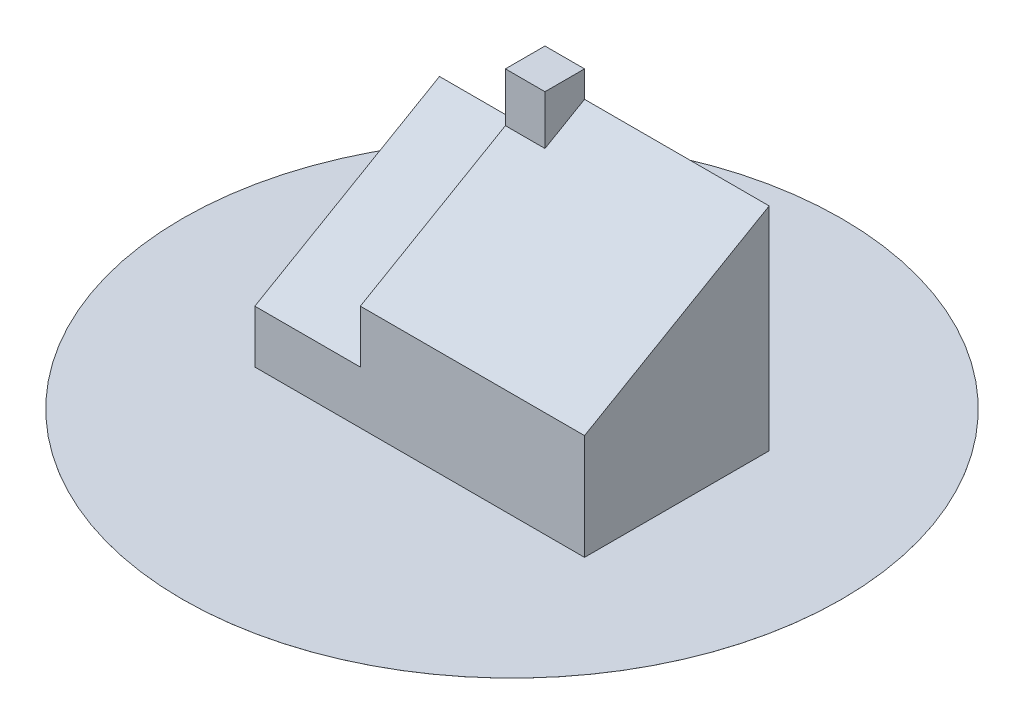
ISO-10303-21;
HEADER;
FILE_DESCRIPTION(('STEP AP214'),'2;1');
FILE_NAME('part.step','',(''),(''),'','','');
FILE_SCHEMA(('AUTOMOTIVE_DESIGN { 1 0 10303 214 1 1 1 1 }'));
ENDSEC;
DATA;
#1=APPLICATION_CONTEXT('core data for automotive mechanical design processes');
#2=APPLICATION_PROTOCOL_DEFINITION('international standard','automotive_design',2000,#1);
#3=PRODUCT_CONTEXT('',#1,'mechanical');
#4=PRODUCT('Part','Part','',(#3));
#5=PRODUCT_RELATED_PRODUCT_CATEGORY('part','',(#4));
#6=PRODUCT_DEFINITION_FORMATION('','',#4);
#7=PRODUCT_DEFINITION_CONTEXT('part definition',#1,'design');
#8=PRODUCT_DEFINITION('design','',#6,#7);
#9=PRODUCT_DEFINITION_SHAPE('','',#8);
#10=(LENGTH_UNIT() NAMED_UNIT(*) SI_UNIT(.MILLI.,.METRE.));
#11=(NAMED_UNIT(*) PLANE_ANGLE_UNIT() SI_UNIT($,.RADIAN.));
#12=(NAMED_UNIT(*) SI_UNIT($,.STERADIAN.) SOLID_ANGLE_UNIT());
#13=UNCERTAINTY_MEASURE_WITH_UNIT(LENGTH_MEASURE(1.E-05),#10,'distance_accuracy_value','');
#14=(GEOMETRIC_REPRESENTATION_CONTEXT(3) GLOBAL_UNCERTAINTY_ASSIGNED_CONTEXT((#13)) GLOBAL_UNIT_ASSIGNED_CONTEXT((#10,
#11,#12)) REPRESENTATION_CONTEXT('',''));
#15=CARTESIAN_POINT('',(0.,0.,0.));
#16=DIRECTION('',(0.,0.,1.));
#17=DIRECTION('',(1.,0.,0.));
#18=AXIS2_PLACEMENT_3D('',#15,#16,#17);
#19=CARTESIAN_POINT('',(40.,40.,70.));
#20=DIRECTION('',(0.,0.866025403784438,0.500000000000001));
#21=DIRECTION('',(0.,-0.500000000000001,0.866025403784438));
#22=AXIS2_PLACEMENT_3D('',#19,#20,#21);
#23=PLANE('',#22);
#24=DIRECTION('',(0.,-0.500000000000001,0.866025403784438));
#25=VECTOR('',#24,1.);
#26=CARTESIAN_POINT('',(55.,40.,70.));
#27=LINE('',#26,#25);
#28=CARTESIAN_POINT('',(55.,80.414518843274,0.));
#29=VERTEX_POINT('',#28);
#30=CARTESIAN_POINT('',(55.,71.7542648054296,15.));
#31=VERTEX_POINT('',#30);
#32=EDGE_CURVE('E38',#29,#31,#27,.T.);
#33=ORIENTED_EDGE('',*,*,#32,.T.);
#34=DIRECTION('',(-1.,0.,0.));
#35=VECTOR('',#34,1.);
#36=CARTESIAN_POINT('',(40.,71.7542648054295,15.));
#37=LINE('',#36,#35);
#38=CARTESIAN_POINT('',(40.,71.7542648054295,15.));
#39=VERTEX_POINT('',#38);
#40=EDGE_CURVE('E151',#31,#39,#37,.T.);
#41=ORIENTED_EDGE('',*,*,#40,.T.);
#42=DIRECTION('',(0.,-0.500000000000001,0.866025403784438));
#43=VECTOR('',#42,1.);
#44=CARTESIAN_POINT('',(40.,40.,70.));
#45=LINE('',#44,#43);
#46=CARTESIAN_POINT('',(40.,40.,70.));
#47=VERTEX_POINT('',#46);
#48=EDGE_CURVE('E145',#39,#47,#45,.T.);
#49=ORIENTED_EDGE('',*,*,#48,.T.);
#50=DIRECTION('',(1.,0.,0.));
#51=VECTOR('',#50,1.);
#52=CARTESIAN_POINT('',(40.,40.,70.));
#53=LINE('',#52,#51);
#54=CARTESIAN_POINT('',(125.,40.,70.));
#55=VERTEX_POINT('',#54);
#56=EDGE_CURVE('E140',#47,#55,#53,.T.);
#57=ORIENTED_EDGE('',*,*,#56,.T.);
#58=DIRECTION('',(0.,-0.500000000000001,0.866025403784438));
#59=VECTOR('',#58,1.);
#60=CARTESIAN_POINT('',(125.,40.,70.));
#61=LINE('',#60,#59);
#62=CARTESIAN_POINT('',(125.,80.414518843274,0.));
#63=VERTEX_POINT('',#62);
#64=EDGE_CURVE('E149',#63,#55,#61,.T.);
#65=ORIENTED_EDGE('',*,*,#64,.F.);
#66=DIRECTION('',(1.,0.,0.));
#67=VECTOR('',#66,1.);
#68=CARTESIAN_POINT('',(40.,80.414518843274,0.));
#69=LINE('',#68,#67);
#70=EDGE_CURVE('E117',#29,#63,#69,.T.);
#71=ORIENTED_EDGE('',*,*,#70,.F.);
#72=EDGE_LOOP('',(#33,#41,#49,#57,#65,#71));
#73=FACE_BOUND('',#72,.T.);
#74=ADVANCED_FACE('F30',(#73),#23,.T.);
#75=CARTESIAN_POINT('',(0.,20.,0.));
#76=DIRECTION('',(1.,0.,0.));
#77=DIRECTION('',(0.,0.,-1.));
#78=AXIS2_PLACEMENT_3D('',#75,#76,#77);
#79=PLANE('',#78);
#80=DIRECTION('',(0.,-1.,0.));
#81=VECTOR('',#80,1.);
#82=CARTESIAN_POINT('',(0.,20.,0.));
#83=LINE('',#82,#81);
#84=CARTESIAN_POINT('',(0.,60.4145188432732,0.));
#85=VERTEX_POINT('',#84);
#86=CARTESIAN_POINT('',(0.,0.00999999999999959,0.));
#87=VERTEX_POINT('',#86);
#88=EDGE_CURVE('E118',#85,#87,#83,.T.);
#89=ORIENTED_EDGE('',*,*,#88,.T.);
#90=DIRECTION('',(0.,0.,1.));
#91=VECTOR('',#90,1.);
#92=CARTESIAN_POINT('',(0.,0.00999999999999959,0.));
#93=LINE('',#92,#91);
#94=CARTESIAN_POINT('',(0.,0.00999999999999959,70.));
#95=VERTEX_POINT('',#94);
#96=EDGE_CURVE('E45',#87,#95,#93,.T.);
#97=ORIENTED_EDGE('',*,*,#96,.T.);
#98=DIRECTION('',(0.,-1.,0.));
#99=VECTOR('',#98,1.);
#100=CARTESIAN_POINT('',(0.,20.,70.));
#101=LINE('',#100,#99);
#102=CARTESIAN_POINT('',(0.,20.,70.));
#103=VERTEX_POINT('',#102);
#104=EDGE_CURVE('E120',#103,#95,#101,.T.);
#105=ORIENTED_EDGE('',*,*,#104,.F.);
#106=DIRECTION('',(0.,0.499999999999995,-0.866025403784442));
#107=VECTOR('',#106,1.);
#108=CARTESIAN_POINT('',(0.,20.,70.));
#109=LINE('',#108,#107);
#110=EDGE_CURVE('E137',#103,#85,#109,.T.);
#111=ORIENTED_EDGE('',*,*,#110,.T.);
#112=EDGE_LOOP('',(#89,#97,#105,#111));
#113=FACE_BOUND('',#112,.T.);
#114=ADVANCED_FACE('F32',(#113),#79,.F.);
#115=CARTESIAN_POINT('',(0.,20.,70.));
#116=DIRECTION('',(0.,0.,-1.));
#117=DIRECTION('',(-1.,0.,0.));
#118=AXIS2_PLACEMENT_3D('',#115,#116,#117);
#119=PLANE('',#118);
#120=ORIENTED_EDGE('',*,*,#104,.T.);
#121=DIRECTION('',(1.,0.,0.));
#122=VECTOR('',#121,1.);
#123=CARTESIAN_POINT('',(0.,0.00999999999999959,70.));
#124=LINE('',#123,#122);
#125=CARTESIAN_POINT('',(125.,0.00999999999999959,70.));
#126=VERTEX_POINT('',#125);
#127=EDGE_CURVE('E112',#95,#126,#124,.T.);
#128=ORIENTED_EDGE('',*,*,#127,.T.);
#129=DIRECTION('',(0.,-1.,0.));
#130=VECTOR('',#129,1.);
#131=CARTESIAN_POINT('',(125.,20.,70.));
#132=LINE('',#131,#130);
#133=EDGE_CURVE('E111',#55,#126,#132,.T.);
#134=ORIENTED_EDGE('',*,*,#133,.F.);
#135=ORIENTED_EDGE('',*,*,#56,.F.);
#136=DIRECTION('',(0.,-1.,0.));
#137=VECTOR('',#136,1.);
#138=CARTESIAN_POINT('',(40.,20.,70.));
#139=LINE('',#138,#137);
#140=CARTESIAN_POINT('',(40.,20.,70.));
#141=VERTEX_POINT('',#140);
#142=EDGE_CURVE('E142',#47,#141,#139,.T.);
#143=ORIENTED_EDGE('',*,*,#142,.T.);
#144=DIRECTION('',(1.,0.,0.));
#145=VECTOR('',#144,1.);
#146=CARTESIAN_POINT('',(0.,20.,70.));
#147=LINE('',#146,#145);
#148=EDGE_CURVE('E122',#103,#141,#147,.T.);
#149=ORIENTED_EDGE('',*,*,#148,.F.);
#150=EDGE_LOOP('',(#120,#128,#134,#135,#143,#149));
#151=FACE_BOUND('',#150,.T.);
#152=ADVANCED_FACE('F198',(#151),#119,.F.);
#153=CARTESIAN_POINT('',(125.,20.,0.));
#154=DIRECTION('',(-1.,0.,0.));
#155=DIRECTION('',(0.,0.,1.));
#156=AXIS2_PLACEMENT_3D('',#153,#154,#155);
#157=PLANE('',#156);
#158=ORIENTED_EDGE('',*,*,#133,.T.);
#159=DIRECTION('',(0.,0.,-1.));
#160=VECTOR('',#159,1.);
#161=CARTESIAN_POINT('',(125.,0.00999999999999959,0.));
#162=LINE('',#161,#160);
#163=CARTESIAN_POINT('',(125.,0.00999999999999959,0.));
#164=VERTEX_POINT('',#163);
#165=EDGE_CURVE('E100',#126,#164,#162,.T.);
#166=ORIENTED_EDGE('',*,*,#165,.T.);
#167=DIRECTION('',(0.,-1.,0.));
#168=VECTOR('',#167,1.);
#169=CARTESIAN_POINT('',(125.,20.,0.));
#170=LINE('',#169,#168);
#171=EDGE_CURVE('E109',#63,#164,#170,.T.);
#172=ORIENTED_EDGE('',*,*,#171,.F.);
#173=ORIENTED_EDGE('',*,*,#64,.T.);
#174=EDGE_LOOP('',(#158,#166,#172,#173));
#175=FACE_BOUND('',#174,.T.);
#176=ADVANCED_FACE('F107',(#175),#157,.F.);
#177=CARTESIAN_POINT('',(0.,20.,0.));
#178=DIRECTION('',(0.,0.,1.));
#179=DIRECTION('',(1.,0.,0.));
#180=AXIS2_PLACEMENT_3D('',#177,#178,#179);
#181=PLANE('',#180);
#182=ORIENTED_EDGE('',*,*,#171,.T.);
#183=DIRECTION('',(-1.,0.,0.));
#184=VECTOR('',#183,1.);
#185=CARTESIAN_POINT('',(0.,0.00999999999999959,0.));
#186=LINE('',#185,#184);
#187=EDGE_CURVE('E11',#164,#87,#186,.T.);
#188=ORIENTED_EDGE('',*,*,#187,.T.);
#189=ORIENTED_EDGE('',*,*,#88,.F.);
#190=DIRECTION('',(-1.,0.,0.));
#191=VECTOR('',#190,1.);
#192=CARTESIAN_POINT('',(40.,60.4145188432732,0.));
#193=LINE('',#192,#191);
#194=CARTESIAN_POINT('',(40.,60.4145188432732,0.));
#195=VERTEX_POINT('',#194);
#196=EDGE_CURVE('E130',#195,#85,#193,.T.);
#197=ORIENTED_EDGE('',*,*,#196,.F.);
#198=DIRECTION('',(0.,1.,0.));
#199=VECTOR('',#198,1.);
#200=CARTESIAN_POINT('',(40.,80.414518843274,0.));
#201=LINE('',#200,#199);
#202=CARTESIAN_POINT('',(40.,90.414518843274,0.));
#203=VERTEX_POINT('',#202);
#204=EDGE_CURVE('E147',#195,#203,#201,.T.);
#205=ORIENTED_EDGE('',*,*,#204,.T.);
#206=DIRECTION('',(-1.,0.,0.));
#207=VECTOR('',#206,1.);
#208=CARTESIAN_POINT('',(40.,90.414518843274,0.));
#209=LINE('',#208,#207);
#210=CARTESIAN_POINT('',(55.,90.414518843274,0.));
#211=VERTEX_POINT('',#210);
#212=EDGE_CURVE('E160',#211,#203,#209,.T.);
#213=ORIENTED_EDGE('',*,*,#212,.F.);
#214=DIRECTION('',(0.,-1.,0.));
#215=VECTOR('',#214,1.);
#216=CARTESIAN_POINT('',(55.,90.414518843274,0.));
#217=LINE('',#216,#215);
#218=EDGE_CURVE('E52',#211,#29,#217,.T.);
#219=ORIENTED_EDGE('',*,*,#218,.T.);
#220=ORIENTED_EDGE('',*,*,#70,.T.);
#221=EDGE_LOOP('',(#182,#188,#189,#197,#205,#213,#219,#220));
#222=FACE_BOUND('',#221,.T.);
#223=ADVANCED_FACE('F115',(#222),#181,.F.);
#224=CARTESIAN_POINT('',(40.,20.,70.));
#225=DIRECTION('',(0.,0.866025403784442,0.499999999999995));
#226=DIRECTION('',(0.,-0.499999999999995,0.866025403784442));
#227=AXIS2_PLACEMENT_3D('',#224,#225,#226);
#228=PLANE('',#227);
#229=ORIENTED_EDGE('',*,*,#110,.F.);
#230=ORIENTED_EDGE('',*,*,#148,.T.);
#231=DIRECTION('',(0.,0.499999999999995,-0.866025403784442));
#232=VECTOR('',#231,1.);
#233=CARTESIAN_POINT('',(40.,20.,70.));
#234=LINE('',#233,#232);
#235=EDGE_CURVE('E131',#141,#195,#234,.T.);
#236=ORIENTED_EDGE('',*,*,#235,.T.);
#237=ORIENTED_EDGE('',*,*,#196,.T.);
#238=EDGE_LOOP('',(#229,#230,#236,#237));
#239=FACE_BOUND('',#238,.T.);
#240=ADVANCED_FACE('F204',(#239),#228,.T.);
#241=CARTESIAN_POINT('',(40.,20.,70.));
#242=DIRECTION('',(-1.,0.,0.));
#243=DIRECTION('',(0.,0.,1.));
#244=AXIS2_PLACEMENT_3D('',#241,#242,#243);
#245=PLANE('',#244);
#246=ORIENTED_EDGE('',*,*,#48,.F.);
#247=DIRECTION('',(0.,-1.,0.));
#248=VECTOR('',#247,1.);
#249=CARTESIAN_POINT('',(40.,90.414518843274,15.));
#250=LINE('',#249,#248);
#251=CARTESIAN_POINT('',(40.,90.414518843274,15.));
#252=VERTEX_POINT('',#251);
#253=EDGE_CURVE('E154',#252,#39,#250,.T.);
#254=ORIENTED_EDGE('',*,*,#253,.F.);
#255=DIRECTION('',(0.,0.,1.));
#256=VECTOR('',#255,1.);
#257=CARTESIAN_POINT('',(40.,90.414518843274,0.));
#258=LINE('',#257,#256);
#259=EDGE_CURVE('E167',#203,#252,#258,.T.);
#260=ORIENTED_EDGE('',*,*,#259,.F.);
#261=ORIENTED_EDGE('',*,*,#204,.F.);
#262=ORIENTED_EDGE('',*,*,#235,.F.);
#263=ORIENTED_EDGE('',*,*,#142,.F.);
#264=EDGE_LOOP('',(#246,#254,#260,#261,#262,#263));
#265=FACE_BOUND('',#264,.T.);
#266=ADVANCED_FACE('F202',(#265),#245,.T.);
#267=CARTESIAN_POINT('',(40.,90.414518843274,15.));
#268=DIRECTION('',(0.,0.,-1.));
#269=DIRECTION('',(-1.,0.,0.));
#270=AXIS2_PLACEMENT_3D('',#267,#268,#269);
#271=PLANE('',#270);
#272=ORIENTED_EDGE('',*,*,#40,.F.);
#273=DIRECTION('',(0.,-1.,0.));
#274=VECTOR('',#273,1.);
#275=CARTESIAN_POINT('',(55.,90.414518843274,15.));
#276=LINE('',#275,#274);
#277=CARTESIAN_POINT('',(55.,90.414518843274,15.));
#278=VERTEX_POINT('',#277);
#279=EDGE_CURVE('E156',#278,#31,#276,.T.);
#280=ORIENTED_EDGE('',*,*,#279,.F.);
#281=DIRECTION('',(1.,0.,0.));
#282=VECTOR('',#281,1.);
#283=CARTESIAN_POINT('',(40.,90.414518843274,15.));
#284=LINE('',#283,#282);
#285=EDGE_CURVE('E165',#252,#278,#284,.T.);
#286=ORIENTED_EDGE('',*,*,#285,.F.);
#287=ORIENTED_EDGE('',*,*,#253,.T.);
#288=EDGE_LOOP('',(#272,#280,#286,#287));
#289=FACE_BOUND('',#288,.T.);
#290=ADVANCED_FACE('F211',(#289),#271,.F.);
#291=CARTESIAN_POINT('',(55.,90.414518843274,0.));
#292=DIRECTION('',(-1.,0.,0.));
#293=DIRECTION('',(0.,0.,1.));
#294=AXIS2_PLACEMENT_3D('',#291,#292,#293);
#295=PLANE('',#294);
#296=ORIENTED_EDGE('',*,*,#32,.F.);
#297=ORIENTED_EDGE('',*,*,#218,.F.);
#298=DIRECTION('',(0.,0.,-1.));
#299=VECTOR('',#298,1.);
#300=CARTESIAN_POINT('',(55.,90.414518843274,0.));
#301=LINE('',#300,#299);
#302=EDGE_CURVE('E163',#278,#211,#301,.T.);
#303=ORIENTED_EDGE('',*,*,#302,.F.);
#304=ORIENTED_EDGE('',*,*,#279,.T.);
#305=EDGE_LOOP('',(#296,#297,#303,#304));
#306=FACE_BOUND('',#305,.T.);
#307=ADVANCED_FACE('F229',(#306),#295,.F.);
#308=CARTESIAN_POINT('',(40.,90.414518843274,15.));
#309=DIRECTION('',(0.,1.,0.));
#310=DIRECTION('',(0.,0.,1.));
#311=AXIS2_PLACEMENT_3D('',#308,#309,#310);
#312=PLANE('',#311);
#313=ORIENTED_EDGE('',*,*,#259,.T.);
#314=ORIENTED_EDGE('',*,*,#285,.T.);
#315=ORIENTED_EDGE('',*,*,#302,.T.);
#316=ORIENTED_EDGE('',*,*,#212,.T.);
#317=EDGE_LOOP('',(#313,#314,#315,#316));
#318=FACE_BOUND('',#317,.T.);
#319=ADVANCED_FACE('F225',(#318),#312,.T.);
#320=CARTESIAN_POINT('',(62.5,0.01,35.));
#321=DIRECTION('',(0.,1.,0.));
#322=DIRECTION('',(0.,0.,1.));
#323=AXIS2_PLACEMENT_3D('',#320,#321,#322);
#324=PLANE('',#323);
#325=CARTESIAN_POINT('',(62.5,0.01,35.));
#326=DIRECTION('',(0.,1.,0.));
#327=DIRECTION('',(0.,0.,1.));
#328=AXIS2_PLACEMENT_3D('',#325,#326,#327);
#329=CIRCLE('',#328,125.);
#330=CARTESIAN_POINT('',(62.5,0.01,160.));
#331=VERTEX_POINT('',#330);
#332=EDGE_CURVE('E113',#331,#331,#329,.T.);
#333=ORIENTED_EDGE('',*,*,#332,.T.);
#334=EDGE_LOOP('',(#333));
#335=FACE_BOUND('',#334,.T.);
#336=ORIENTED_EDGE('',*,*,#96,.F.);
#337=ORIENTED_EDGE('',*,*,#187,.F.);
#338=ORIENTED_EDGE('',*,*,#165,.F.);
#339=ORIENTED_EDGE('',*,*,#127,.F.);
#340=EDGE_LOOP('',(#336,#337,#338,#339));
#341=FACE_BOUND('',#340,.T.);
#342=ADVANCED_FACE('F99',(#335,#341),#324,.T.);
#343=CARTESIAN_POINT('',(62.5,0.01,35.));
#344=DIRECTION('',(0.,-1.,0.));
#345=DIRECTION('',(0.,0.,-1.));
#346=AXIS2_PLACEMENT_3D('',#343,#344,#345);
#347=CYLINDRICAL_SURFACE('',#346,125.);
#348=ORIENTED_EDGE('',*,*,#332,.F.);
#349=EDGE_LOOP('',(#348));
#350=FACE_BOUND('',#349,.T.);
#351=CARTESIAN_POINT('',(62.5,0.,35.));
#352=DIRECTION('',(0.,1.,0.));
#353=DIRECTION('',(0.,0.,1.));
#354=AXIS2_PLACEMENT_3D('',#351,#352,#353);
#355=CIRCLE('',#354,125.);
#356=CARTESIAN_POINT('',(62.5,0.,160.));
#357=VERTEX_POINT('',#356);
#358=EDGE_CURVE('E172',#357,#357,#355,.T.);
#359=ORIENTED_EDGE('',*,*,#358,.T.);
#360=EDGE_LOOP('',(#359));
#361=FACE_BOUND('',#360,.T.);
#362=ADVANCED_FACE('F179',(#350,#361),#347,.T.);
#363=CARTESIAN_POINT('',(0.,0.,70.));
#364=DIRECTION('',(0.,1.,0.));
#365=DIRECTION('',(0.,0.,1.));
#366=AXIS2_PLACEMENT_3D('',#363,#364,#365);
#367=PLANE('',#366);
#368=ORIENTED_EDGE('',*,*,#358,.F.);
#369=EDGE_LOOP('',(#368));
#370=FACE_BOUND('',#369,.T.);
#371=ADVANCED_FACE('F182',(#370),#367,.F.);
#372=CLOSED_SHELL('',(#74,#114,#152,#176,#223,#240,#266,#290,#307,#319,#342,#362,#371));
#373=MANIFOLD_SOLID_BREP('B2',#372);
#374=ADVANCED_BREP_SHAPE_REPRESENTATION('',(#18,#373),#14);
#375=SHAPE_DEFINITION_REPRESENTATION(#9,#374);
ENDSEC;
END-ISO-10303-21;
